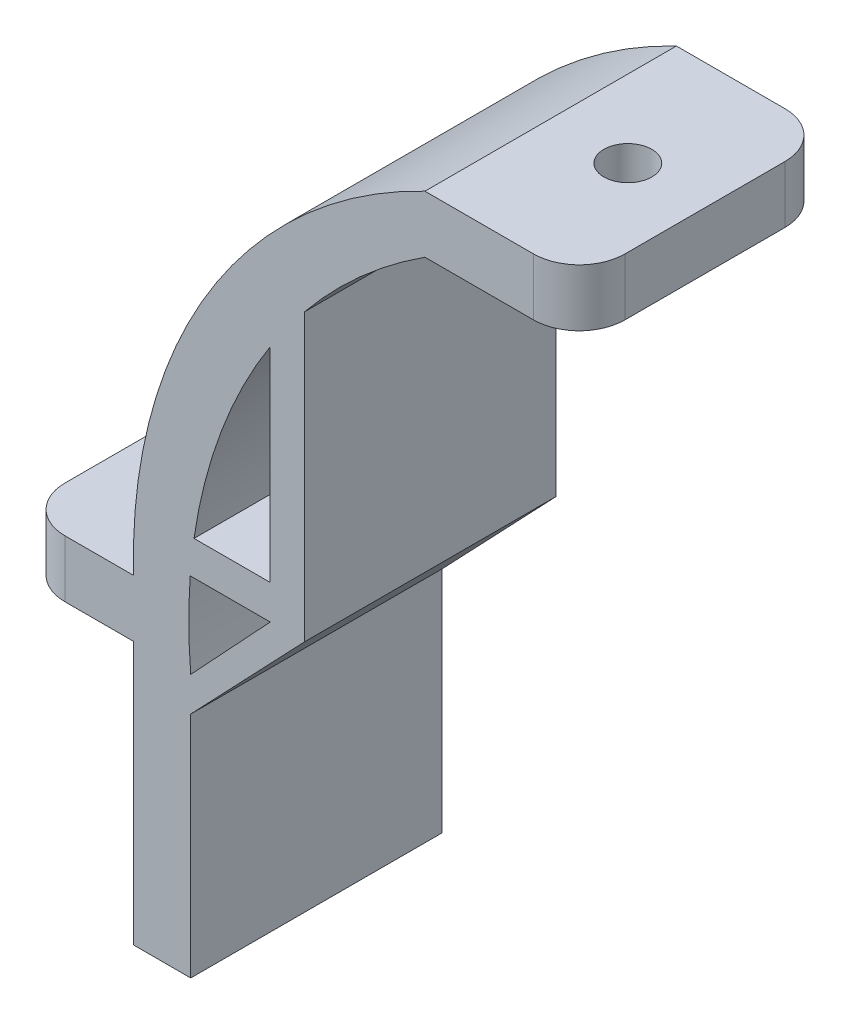
ISO-10303-21;
HEADER;
FILE_DESCRIPTION(('STEP AP214'),'2;1');
FILE_NAME('part.step','',(''),(''),'','','');
FILE_SCHEMA(('AUTOMOTIVE_DESIGN { 1 0 10303 214 1 1 1 1 }'));
ENDSEC;
DATA;
#1=APPLICATION_CONTEXT('core data for automotive mechanical design processes');
#2=APPLICATION_PROTOCOL_DEFINITION('international standard','automotive_design',2000,#1);
#3=PRODUCT_CONTEXT('',#1,'mechanical');
#4=PRODUCT('Part','Part','',(#3));
#5=PRODUCT_RELATED_PRODUCT_CATEGORY('part','',(#4));
#6=PRODUCT_DEFINITION_FORMATION('','',#4);
#7=PRODUCT_DEFINITION_CONTEXT('part definition',#1,'design');
#8=PRODUCT_DEFINITION('design','',#6,#7);
#9=PRODUCT_DEFINITION_SHAPE('','',#8);
#10=(LENGTH_UNIT() NAMED_UNIT(*) SI_UNIT(.MILLI.,.METRE.));
#11=(NAMED_UNIT(*) PLANE_ANGLE_UNIT() SI_UNIT($,.RADIAN.));
#12=(NAMED_UNIT(*) SI_UNIT($,.STERADIAN.) SOLID_ANGLE_UNIT());
#13=UNCERTAINTY_MEASURE_WITH_UNIT(LENGTH_MEASURE(1.E-05),#10,'distance_accuracy_value','');
#14=(GEOMETRIC_REPRESENTATION_CONTEXT(3) GLOBAL_UNCERTAINTY_ASSIGNED_CONTEXT((#13)) GLOBAL_UNIT_ASSIGNED_CONTEXT((#10,
#11,#12)) REPRESENTATION_CONTEXT('',''));
#15=CARTESIAN_POINT('',(0.,0.,0.));
#16=DIRECTION('',(0.,0.,1.));
#17=DIRECTION('',(1.,0.,0.));
#18=AXIS2_PLACEMENT_3D('',#15,#16,#17);
#19=CARTESIAN_POINT('',(0.,225.859750776681,0.));
#20=DIRECTION('',(0.,1.,0.));
#21=DIRECTION('',(0.,0.,1.));
#22=AXIS2_PLACEMENT_3D('',#19,#20,#21);
#23=PLANE('',#22);
#24=DIRECTION('',(0.,0.,1.));
#25=VECTOR('',#24,1.);
#26=CARTESIAN_POINT('',(-25.2653617340679,225.859750776681,0.));
#27=LINE('',#26,#25);
#28=CARTESIAN_POINT('',(-25.2653617340679,225.859750776681,-3.));
#29=VERTEX_POINT('',#28);
#30=CARTESIAN_POINT('',(-25.2653617340679,225.859750776681,19.));
#31=VERTEX_POINT('',#30);
#32=EDGE_CURVE('E377',#29,#31,#27,.T.);
#33=ORIENTED_EDGE('',*,*,#32,.T.);
#34=DIRECTION('',(-1.,0.,0.));
#35=VECTOR('',#34,1.);
#36=CARTESIAN_POINT('',(0.,225.859750776681,19.));
#37=LINE('',#36,#35);
#38=CARTESIAN_POINT('',(-18.5973694260722,225.859750776681,19.));
#39=VERTEX_POINT('',#38);
#40=EDGE_CURVE('E330',#39,#31,#37,.T.);
#41=ORIENTED_EDGE('',*,*,#40,.F.);
#42=DIRECTION('',(0.,0.,1.));
#43=VECTOR('',#42,1.);
#44=CARTESIAN_POINT('',(-18.5973694260722,225.859750776681,0.));
#45=LINE('',#44,#43);
#46=CARTESIAN_POINT('',(-18.5973694260722,225.859750776681,-3.));
#47=VERTEX_POINT('',#46);
#48=EDGE_CURVE('E380',#47,#39,#45,.T.);
#49=ORIENTED_EDGE('',*,*,#48,.F.);
#50=DIRECTION('',(1.,0.,0.));
#51=VECTOR('',#50,1.);
#52=CARTESIAN_POINT('',(0.,225.859750776681,-3.));
#53=LINE('',#52,#51);
#54=EDGE_CURVE('E267',#29,#47,#53,.T.);
#55=ORIENTED_EDGE('',*,*,#54,.F.);
#56=EDGE_LOOP('',(#33,#41,#49,#55));
#57=FACE_BOUND('',#56,.T.);
#58=ADVANCED_FACE('F41',(#57),#23,.T.);
#59=CARTESIAN_POINT('',(-18.5973694260721,0.,0.));
#60=DIRECTION('',(-1.,0.,0.));
#61=DIRECTION('',(0.,-1.,0.));
#62=AXIS2_PLACEMENT_3D('',#59,#60,#61);
#63=PLANE('',#62);
#64=ORIENTED_EDGE('',*,*,#48,.T.);
#65=DIRECTION('',(0.,-1.,0.));
#66=VECTOR('',#65,1.);
#67=CARTESIAN_POINT('',(-18.5973694260721,0.,19.));
#68=LINE('',#67,#66);
#69=CARTESIAN_POINT('',(-18.5973694260722,243.723778379767,19.));
#70=VERTEX_POINT('',#69);
#71=EDGE_CURVE('E326',#70,#39,#68,.T.);
#72=ORIENTED_EDGE('',*,*,#71,.F.);
#73=DIRECTION('',(0.,0.,1.));
#74=VECTOR('',#73,1.);
#75=CARTESIAN_POINT('',(-18.5973694260722,243.723778379767,0.));
#76=LINE('',#75,#74);
#77=CARTESIAN_POINT('',(-18.5973694260722,243.723778379767,-3.));
#78=VERTEX_POINT('',#77);
#79=EDGE_CURVE('E359',#78,#70,#76,.T.);
#80=ORIENTED_EDGE('',*,*,#79,.F.);
#81=DIRECTION('',(0.,1.,0.));
#82=VECTOR('',#81,1.);
#83=CARTESIAN_POINT('',(-18.5973694260721,0.,-3.));
#84=LINE('',#83,#82);
#85=EDGE_CURVE('E259',#47,#78,#84,.T.);
#86=ORIENTED_EDGE('',*,*,#85,.F.);
#87=EDGE_LOOP('',(#64,#72,#80,#86));
#88=FACE_BOUND('',#87,.T.);
#89=ADVANCED_FACE('F477',(#88),#63,.T.);
#90=CARTESIAN_POINT('',(19.2704077275692,219.412639915224,45.));
#91=DIRECTION('',(0.,0.,-1.));
#92=DIRECTION('',(-1.,0.,0.));
#93=AXIS2_PLACEMENT_3D('',#90,#91,#92);
#94=CYLINDRICAL_SURFACE('',#93,45.);
#95=ORIENTED_EDGE('',*,*,#79,.T.);
#96=CARTESIAN_POINT('',(19.2704077275692,219.412639915224,19.));
#97=DIRECTION('',(0.,0.,1.));
#98=DIRECTION('',(1.,0.,0.));
#99=AXIS2_PLACEMENT_3D('',#96,#97,#98);
#100=CIRCLE('',#99,45.);
#101=EDGE_CURVE('E322',#31,#70,#100,.F.);
#102=ORIENTED_EDGE('',*,*,#101,.F.);
#103=ORIENTED_EDGE('',*,*,#32,.F.);
#104=CARTESIAN_POINT('',(19.2704077275692,219.412639915224,-3.));
#105=DIRECTION('',(0.,0.,-1.));
#106=DIRECTION('',(-1.,0.,0.));
#107=AXIS2_PLACEMENT_3D('',#104,#105,#106);
#108=CIRCLE('',#107,45.);
#109=EDGE_CURVE('E263',#78,#29,#108,.F.);
#110=ORIENTED_EDGE('',*,*,#109,.F.);
#111=EDGE_LOOP('',(#95,#102,#103,#110));
#112=FACE_BOUND('',#111,.T.);
#113=ADVANCED_FACE('F483',(#112),#94,.F.);
#114=CARTESIAN_POINT('',(0.,222.859750776681,0.));
#115=DIRECTION('',(0.,-1.,0.));
#116=DIRECTION('',(0.,0.,-1.));
#117=AXIS2_PLACEMENT_3D('',#114,#115,#116);
#118=PLANE('',#117);
#119=DIRECTION('',(0.,0.,1.));
#120=VECTOR('',#119,1.);
#121=CARTESIAN_POINT('',(-18.5973694260722,222.859750776681,0.));
#122=LINE('',#121,#120);
#123=CARTESIAN_POINT('',(-18.5973694260722,222.859750776681,-3.));
#124=VERTEX_POINT('',#123);
#125=CARTESIAN_POINT('',(-18.5973694260722,222.859750776681,19.));
#126=VERTEX_POINT('',#125);
#127=EDGE_CURVE('E371',#124,#126,#122,.T.);
#128=ORIENTED_EDGE('',*,*,#127,.T.);
#129=DIRECTION('',(1.,0.,0.));
#130=VECTOR('',#129,1.);
#131=CARTESIAN_POINT('',(0.,222.859750776681,19.));
#132=LINE('',#131,#130);
#133=CARTESIAN_POINT('',(-25.5973694260722,222.859750776681,19.));
#134=VERTEX_POINT('',#133);
#135=EDGE_CURVE('E338',#134,#126,#132,.T.);
#136=ORIENTED_EDGE('',*,*,#135,.F.);
#137=DIRECTION('',(0.,0.,1.));
#138=VECTOR('',#137,1.);
#139=CARTESIAN_POINT('',(-25.5973694260722,222.859750776681,0.));
#140=LINE('',#139,#138);
#141=CARTESIAN_POINT('',(-25.5973694260722,222.859750776681,-3.));
#142=VERTEX_POINT('',#141);
#143=EDGE_CURVE('E374',#142,#134,#140,.T.);
#144=ORIENTED_EDGE('',*,*,#143,.F.);
#145=DIRECTION('',(-1.,0.,0.));
#146=VECTOR('',#145,1.);
#147=CARTESIAN_POINT('',(0.,222.859750776681,-3.));
#148=LINE('',#147,#146);
#149=EDGE_CURVE('E271',#124,#142,#148,.T.);
#150=ORIENTED_EDGE('',*,*,#149,.F.);
#151=EDGE_LOOP('',(#128,#136,#144,#150));
#152=FACE_BOUND('',#151,.T.);
#153=ADVANCED_FACE('F487',(#152),#118,.T.);
#154=CARTESIAN_POINT('',(-121.103180433286,113.114334706377,0.));
#155=DIRECTION('',(-0.730800263175056,0.682591367762052,0.));
#156=DIRECTION('',(-0.682591367762052,-0.730800263175056,0.));
#157=AXIS2_PLACEMENT_3D('',#154,#155,#156);
#158=PLANE('',#157);
#159=DIRECTION('',(0.,0.,-1.));
#160=VECTOR('',#159,1.);
#161=CARTESIAN_POINT('',(-25.5516147708674,215.414352888303,45.));
#162=LINE('',#161,#160);
#163=CARTESIAN_POINT('',(-25.5516147708673,215.414352888303,19.));
#164=VERTEX_POINT('',#163);
#165=CARTESIAN_POINT('',(-25.5516147708674,215.414352888303,-3.));
#166=VERTEX_POINT('',#165);
#167=EDGE_CURVE('E362',#164,#166,#162,.T.);
#168=ORIENTED_EDGE('',*,*,#167,.F.);
#169=DIRECTION('',(-0.682591367762052,-0.730800263175056,0.));
#170=VECTOR('',#169,1.);
#171=CARTESIAN_POINT('',(-121.103180433286,113.114334706377,19.));
#172=LINE('',#171,#170);
#173=EDGE_CURVE('E342',#126,#164,#172,.T.);
#174=ORIENTED_EDGE('',*,*,#173,.F.);
#175=ORIENTED_EDGE('',*,*,#127,.F.);
#176=DIRECTION('',(0.682591367762052,0.730800263175056,0.));
#177=VECTOR('',#176,1.);
#178=CARTESIAN_POINT('',(-121.103180433286,113.114334706377,-3.));
#179=LINE('',#178,#177);
#180=EDGE_CURVE('E279',#166,#124,#179,.T.);
#181=ORIENTED_EDGE('',*,*,#180,.F.);
#182=EDGE_LOOP('',(#168,#174,#175,#181));
#183=FACE_BOUND('',#182,.T.);
#184=ADVANCED_FACE('F579',(#183),#158,.T.);
#185=ORIENTED_EDGE('',*,*,#143,.T.);
#186=CARTESIAN_POINT('',(19.2704077275692,219.412639915224,19.));
#187=DIRECTION('',(0.,0.,1.));
#188=DIRECTION('',(1.,0.,0.));
#189=AXIS2_PLACEMENT_3D('',#186,#187,#188);
#190=CIRCLE('',#189,45.);
#191=EDGE_CURVE('E334',#164,#134,#190,.F.);
#192=ORIENTED_EDGE('',*,*,#191,.F.);
#193=ORIENTED_EDGE('',*,*,#167,.T.);
#194=CARTESIAN_POINT('',(19.2704077275692,219.412639915224,-3.));
#195=DIRECTION('',(0.,0.,-1.));
#196=DIRECTION('',(-1.,0.,0.));
#197=AXIS2_PLACEMENT_3D('',#194,#195,#196);
#198=CIRCLE('',#197,45.);
#199=EDGE_CURVE('E275',#142,#166,#198,.F.);
#200=ORIENTED_EDGE('',*,*,#199,.F.);
#201=EDGE_LOOP('',(#185,#192,#193,#200));
#202=FACE_BOUND('',#201,.T.);
#203=ADVANCED_FACE('F493',(#202),#94,.F.);
#204=CARTESIAN_POINT('',(-25.5516147708674,0.,45.));
#205=DIRECTION('',(1.,0.,0.));
#206=DIRECTION('',(0.,0.,-1.));
#207=AXIS2_PLACEMENT_3D('',#204,#205,#206);
#208=PLANE('',#207);
#209=DIRECTION('',(0.,0.,1.));
#210=VECTOR('',#209,1.);
#211=CARTESIAN_POINT('',(-25.5516147708674,212.414352888303,0.));
#212=LINE('',#211,#210);
#213=CARTESIAN_POINT('',(-25.5516147708674,212.414352888303,-3.));
#214=VERTEX_POINT('',#213);
#215=CARTESIAN_POINT('',(-25.5516147708673,212.414352888303,19.));
#216=VERTEX_POINT('',#215);
#217=EDGE_CURVE('E368',#214,#216,#212,.T.);
#218=ORIENTED_EDGE('',*,*,#217,.T.);
#219=DIRECTION('',(0.,1.,0.));
#220=VECTOR('',#219,1.);
#221=CARTESIAN_POINT('',(-25.5516147708674,0.,19.));
#222=LINE('',#221,#220);
#223=CARTESIAN_POINT('',(-25.5516147708674,192.414352888303,19.));
#224=VERTEX_POINT('',#223);
#225=EDGE_CURVE('E305',#224,#216,#222,.T.);
#226=ORIENTED_EDGE('',*,*,#225,.F.);
#227=DIRECTION('',(0.,0.,-1.));
#228=VECTOR('',#227,1.);
#229=CARTESIAN_POINT('',(-25.5516147708674,192.414352888303,45.));
#230=LINE('',#229,#228);
#231=CARTESIAN_POINT('',(-25.5516147708674,192.414352888303,-3.));
#232=VERTEX_POINT('',#231);
#233=EDGE_CURVE('E385',#224,#232,#230,.T.);
#234=ORIENTED_EDGE('',*,*,#233,.T.);
#235=DIRECTION('',(0.,-1.,0.));
#236=VECTOR('',#235,1.);
#237=CARTESIAN_POINT('',(-25.5516147708674,0.,-3.));
#238=LINE('',#237,#236);
#239=EDGE_CURVE('E234',#214,#232,#238,.T.);
#240=ORIENTED_EDGE('',*,*,#239,.F.);
#241=EDGE_LOOP('',(#218,#226,#234,#240));
#242=FACE_BOUND('',#241,.T.);
#243=ADVANCED_FACE('F490',(#242),#208,.T.);
#244=DIRECTION('',(0.,0.,-1.));
#245=VECTOR('',#244,1.);
#246=CARTESIAN_POINT('',(-5.06519953005821,257.264696918807,45.));
#247=LINE('',#246,#245);
#248=CARTESIAN_POINT('',(-5.0651995300582,257.264696918807,19.));
#249=VERTEX_POINT('',#248);
#250=CARTESIAN_POINT('',(-5.06519953005819,257.264696918807,-3.));
#251=VERTEX_POINT('',#250);
#252=EDGE_CURVE('E211',#249,#251,#247,.T.);
#253=ORIENTED_EDGE('',*,*,#252,.F.);
#254=CARTESIAN_POINT('',(19.2704077275692,219.412639915224,19.));
#255=DIRECTION('',(0.,0.,1.));
#256=DIRECTION('',(1.,0.,0.));
#257=AXIS2_PLACEMENT_3D('',#254,#255,#256);
#258=CIRCLE('',#257,45.);
#259=CARTESIAN_POINT('',(-15.5973694260722,247.859750776681,19.));
#260=VERTEX_POINT('',#259);
#261=EDGE_CURVE('E317',#260,#249,#258,.F.);
#262=ORIENTED_EDGE('',*,*,#261,.F.);
#263=DIRECTION('',(0.,0.,1.));
#264=VECTOR('',#263,1.);
#265=CARTESIAN_POINT('',(-15.5973694260722,247.859750776681,0.));
#266=LINE('',#265,#264);
#267=CARTESIAN_POINT('',(-15.5973694260722,247.859750776681,-3.));
#268=VERTEX_POINT('',#267);
#269=EDGE_CURVE('E223',#268,#260,#266,.T.);
#270=ORIENTED_EDGE('',*,*,#269,.F.);
#271=CARTESIAN_POINT('',(19.2704077275692,219.412639915224,-3.));
#272=DIRECTION('',(0.,0.,-1.));
#273=DIRECTION('',(-1.,0.,0.));
#274=AXIS2_PLACEMENT_3D('',#271,#272,#273);
#275=CIRCLE('',#274,45.);
#276=EDGE_CURVE('E203',#251,#268,#275,.F.);
#277=ORIENTED_EDGE('',*,*,#276,.F.);
#278=EDGE_LOOP('',(#253,#262,#270,#277));
#279=FACE_BOUND('',#278,.T.);
#280=ADVANCED_FACE('F222',(#279),#94,.F.);
#281=CARTESIAN_POINT('',(0.,257.264696918807,45.));
#282=DIRECTION('',(0.,-1.,0.));
#283=DIRECTION('',(0.,0.,-1.));
#284=AXIS2_PLACEMENT_3D('',#281,#282,#283);
#285=PLANE('',#284);
#286=DIRECTION('',(0.,0.,-1.));
#287=VECTOR('',#286,1.);
#288=CARTESIAN_POINT('',(8.43480046994179,257.264696918807,45.));
#289=LINE('',#288,#287);
#290=CARTESIAN_POINT('',(8.43480046994179,257.264696918807,15.));
#291=VERTEX_POINT('',#290);
#292=CARTESIAN_POINT('',(8.43480046994179,257.264696918807,1.00000000000001));
#293=VERTEX_POINT('',#292);
#294=EDGE_CURVE('E220',#291,#293,#289,.T.);
#295=ORIENTED_EDGE('',*,*,#294,.F.);
#296=CARTESIAN_POINT('',(4.43480046994179,257.264696918807,15.));
#297=DIRECTION('',(0.,-1.,0.));
#298=DIRECTION('',(0.,0.,-1.));
#299=AXIS2_PLACEMENT_3D('',#296,#297,#298);
#300=CIRCLE('',#299,4.);
#301=CARTESIAN_POINT('',(4.43480046994179,257.264696918807,19.));
#302=VERTEX_POINT('',#301);
#303=EDGE_CURVE('E11',#291,#302,#300,.T.);
#304=ORIENTED_EDGE('',*,*,#303,.T.);
#305=DIRECTION('',(1.,0.,0.));
#306=VECTOR('',#305,1.);
#307=CARTESIAN_POINT('',(0.,257.264696918807,19.));
#308=LINE('',#307,#306);
#309=EDGE_CURVE('E215',#249,#302,#308,.T.);
#310=ORIENTED_EDGE('',*,*,#309,.F.);
#311=ORIENTED_EDGE('',*,*,#252,.T.);
#312=DIRECTION('',(-1.,0.,0.));
#313=VECTOR('',#312,1.);
#314=CARTESIAN_POINT('',(0.,257.264696918807,-3.));
#315=LINE('',#314,#313);
#316=CARTESIAN_POINT('',(4.43480046994179,257.264696918807,-3.));
#317=VERTEX_POINT('',#316);
#318=EDGE_CURVE('E196',#317,#251,#315,.T.);
#319=ORIENTED_EDGE('',*,*,#318,.F.);
#320=CARTESIAN_POINT('',(4.43480046994179,257.264696918807,1.));
#321=DIRECTION('',(0.,-1.,0.));
#322=DIRECTION('',(0.,0.,-1.));
#323=AXIS2_PLACEMENT_3D('',#320,#321,#322);
#324=CIRCLE('',#323,4.);
#325=EDGE_CURVE('E50',#317,#293,#324,.T.);
#326=ORIENTED_EDGE('',*,*,#325,.T.);
#327=EDGE_LOOP('',(#295,#304,#310,#311,#319,#326));
#328=FACE_BOUND('',#327,.T.);
#329=CARTESIAN_POINT('',(1.68480046994179,257.264696918807,8.));
#330=DIRECTION('',(0.,-1.,0.));
#331=DIRECTION('',(0.,0.,-1.));
#332=AXIS2_PLACEMENT_3D('',#329,#330,#331);
#333=CIRCLE('',#332,2.1);
#334=CARTESIAN_POINT('',(1.68480046994179,257.264696918807,5.9));
#335=VERTEX_POINT('',#334);
#336=EDGE_CURVE('E350',#335,#335,#333,.T.);
#337=ORIENTED_EDGE('',*,*,#336,.F.);
#338=EDGE_LOOP('',(#337));
#339=FACE_BOUND('',#338,.T.);
#340=ADVANCED_FACE('F212',(#328,#339),#285,.T.);
#341=CARTESIAN_POINT('',(8.43480046994179,0.,45.));
#342=DIRECTION('',(1.,0.,0.));
#343=DIRECTION('',(0.,0.,-1.));
#344=AXIS2_PLACEMENT_3D('',#341,#342,#343);
#345=PLANE('',#344);
#346=DIRECTION('',(0.,0.,-1.));
#347=VECTOR('',#346,1.);
#348=CARTESIAN_POINT('',(8.43480046994179,262.264696918807,45.));
#349=LINE('',#348,#347);
#350=CARTESIAN_POINT('',(8.43480046994179,262.264696918807,15.));
#351=VERTEX_POINT('',#350);
#352=CARTESIAN_POINT('',(8.43480046994179,262.264696918807,1.00000000000001));
#353=VERTEX_POINT('',#352);
#354=EDGE_CURVE('E409',#351,#353,#349,.T.);
#355=ORIENTED_EDGE('',*,*,#354,.F.);
#356=DIRECTION('',(0.,1.,0.));
#357=VECTOR('',#356,1.);
#358=CARTESIAN_POINT('',(8.43480046994179,0.,15.));
#359=LINE('',#358,#357);
#360=EDGE_CURVE('E63',#351,#291,#359,.F.);
#361=ORIENTED_EDGE('',*,*,#360,.T.);
#362=ORIENTED_EDGE('',*,*,#294,.T.);
#363=DIRECTION('',(0.,-1.,0.));
#364=VECTOR('',#363,1.);
#365=CARTESIAN_POINT('',(8.43480046994179,0.,1.));
#366=LINE('',#365,#364);
#367=EDGE_CURVE('E456',#293,#353,#366,.F.);
#368=ORIENTED_EDGE('',*,*,#367,.T.);
#369=EDGE_LOOP('',(#355,#361,#362,#368));
#370=FACE_BOUND('',#369,.T.);
#371=ADVANCED_FACE('F462',(#370),#345,.T.);
#372=CARTESIAN_POINT('',(0.,262.264696918807,45.));
#373=DIRECTION('',(0.,-1.,0.));
#374=DIRECTION('',(0.,0.,-1.));
#375=AXIS2_PLACEMENT_3D('',#372,#373,#374);
#376=PLANE('',#375);
#377=CARTESIAN_POINT('',(1.68480046994179,262.264696918807,8.));
#378=DIRECTION('',(0.,1.,0.));
#379=DIRECTION('',(0.,0.,1.));
#380=AXIS2_PLACEMENT_3D('',#377,#378,#379);
#381=CIRCLE('',#380,2.1);
#382=CARTESIAN_POINT('',(1.68480046994179,262.264696918807,10.1));
#383=VERTEX_POINT('',#382);
#384=EDGE_CURVE('E346',#383,#383,#381,.T.);
#385=ORIENTED_EDGE('',*,*,#384,.F.);
#386=EDGE_LOOP('',(#385));
#387=FACE_BOUND('',#386,.T.);
#388=DIRECTION('',(-1.,0.,0.));
#389=VECTOR('',#388,1.);
#390=CARTESIAN_POINT('',(0.,262.264696918807,19.));
#391=LINE('',#390,#389);
#392=CARTESIAN_POINT('',(4.43480046994179,262.264696918807,19.));
#393=VERTEX_POINT('',#392);
#394=CARTESIAN_POINT('',(-5.06519953005817,262.264696918807,19.));
#395=VERTEX_POINT('',#394);
#396=EDGE_CURVE('E283',#393,#395,#391,.T.);
#397=ORIENTED_EDGE('',*,*,#396,.F.);
#398=CARTESIAN_POINT('',(4.43480046994179,262.264696918807,15.));
#399=DIRECTION('',(0.,-1.,0.));
#400=DIRECTION('',(0.,0.,-1.));
#401=AXIS2_PLACEMENT_3D('',#398,#399,#400);
#402=CIRCLE('',#401,4.);
#403=EDGE_CURVE('E453',#393,#351,#402,.F.);
#404=ORIENTED_EDGE('',*,*,#403,.T.);
#405=ORIENTED_EDGE('',*,*,#354,.T.);
#406=CARTESIAN_POINT('',(4.43480046994179,262.264696918807,1.));
#407=DIRECTION('',(0.,-1.,0.));
#408=DIRECTION('',(0.,0.,-1.));
#409=AXIS2_PLACEMENT_3D('',#406,#407,#408);
#410=CIRCLE('',#409,4.);
#411=CARTESIAN_POINT('',(4.43480046994179,262.264696918807,-3.));
#412=VERTEX_POINT('',#411);
#413=EDGE_CURVE('E450',#353,#412,#410,.F.);
#414=ORIENTED_EDGE('',*,*,#413,.T.);
#415=DIRECTION('',(1.,0.,0.));
#416=VECTOR('',#415,1.);
#417=CARTESIAN_POINT('',(0.,262.264696918807,-3.));
#418=LINE('',#417,#416);
#419=CARTESIAN_POINT('',(-5.0651995300582,262.264696918807,-3.));
#420=VERTEX_POINT('',#419);
#421=EDGE_CURVE('E256',#420,#412,#418,.T.);
#422=ORIENTED_EDGE('',*,*,#421,.F.);
#423=DIRECTION('',(0.,0.,-1.));
#424=VECTOR('',#423,1.);
#425=CARTESIAN_POINT('',(-5.06519953005821,262.264696918807,45.));
#426=LINE('',#425,#424);
#427=EDGE_CURVE('E406',#395,#420,#426,.T.);
#428=ORIENTED_EDGE('',*,*,#427,.F.);
#429=EDGE_LOOP('',(#397,#404,#405,#414,#422,#428));
#430=FACE_BOUND('',#429,.T.);
#431=ADVANCED_FACE('F467',(#387,#430),#376,.F.);
#432=CARTESIAN_POINT('',(14.4298215899234,221.70678583439,45.));
#433=DIRECTION('',(0.,0.,-1.));
#434=DIRECTION('',(-1.,0.,0.));
#435=AXIS2_PLACEMENT_3D('',#432,#433,#434);
#436=CYLINDRICAL_SURFACE('',#435,45.);
#437=DIRECTION('',(0.,0.,-1.));
#438=VECTOR('',#437,1.);
#439=CARTESIAN_POINT('',(-30.5516147708674,220.414352888303,45.));
#440=LINE('',#439,#438);
#441=CARTESIAN_POINT('',(-30.5516147708674,220.414352888303,19.));
#442=VERTEX_POINT('',#441);
#443=CARTESIAN_POINT('',(-30.5516147708674,220.414352888303,-3.));
#444=VERTEX_POINT('',#443);
#445=EDGE_CURVE('E402',#442,#444,#440,.T.);
#446=ORIENTED_EDGE('',*,*,#445,.F.);
#447=CARTESIAN_POINT('',(14.4298215899234,221.70678583439,19.));
#448=DIRECTION('',(0.,0.,1.));
#449=DIRECTION('',(1.,0.,0.));
#450=AXIS2_PLACEMENT_3D('',#447,#448,#449);
#451=CIRCLE('',#450,45.);
#452=EDGE_CURVE('E286',#395,#442,#451,.T.);
#453=ORIENTED_EDGE('',*,*,#452,.F.);
#454=ORIENTED_EDGE('',*,*,#427,.T.);
#455=CARTESIAN_POINT('',(14.4298215899234,221.70678583439,-3.));
#456=DIRECTION('',(0.,0.,-1.));
#457=DIRECTION('',(-1.,0.,0.));
#458=AXIS2_PLACEMENT_3D('',#455,#456,#457);
#459=CIRCLE('',#458,45.);
#460=EDGE_CURVE('E252',#444,#420,#459,.T.);
#461=ORIENTED_EDGE('',*,*,#460,.F.);
#462=EDGE_LOOP('',(#446,#453,#454,#461));
#463=FACE_BOUND('',#462,.T.);
#464=ADVANCED_FACE('F515',(#463),#436,.T.);
#465=CARTESIAN_POINT('',(0.,220.414352888303,45.));
#466=DIRECTION('',(0.,1.,0.));
#467=DIRECTION('',(0.,0.,1.));
#468=AXIS2_PLACEMENT_3D('',#465,#466,#467);
#469=PLANE('',#468);
#470=DIRECTION('',(1.,0.,0.));
#471=VECTOR('',#470,1.);
#472=CARTESIAN_POINT('',(0.,220.414352888303,-3.));
#473=LINE('',#472,#471);
#474=CARTESIAN_POINT('',(-36.5516147708674,220.414352888303,-3.));
#475=VERTEX_POINT('',#474);
#476=EDGE_CURVE('E249',#475,#444,#473,.T.);
#477=ORIENTED_EDGE('',*,*,#476,.F.);
#478=CARTESIAN_POINT('',(-36.5516147708674,220.414352888303,1.));
#479=DIRECTION('',(0.,1.,0.));
#480=DIRECTION('',(0.,0.,1.));
#481=AXIS2_PLACEMENT_3D('',#478,#479,#480);
#482=CIRCLE('',#481,4.);
#483=CARTESIAN_POINT('',(-40.5516147708674,220.414352888303,1.00000000000001));
#484=VERTEX_POINT('',#483);
#485=EDGE_CURVE('E427',#475,#484,#482,.T.);
#486=ORIENTED_EDGE('',*,*,#485,.T.);
#487=DIRECTION('',(0.,0.,-1.));
#488=VECTOR('',#487,1.);
#489=CARTESIAN_POINT('',(-40.5516147708674,220.414352888303,45.));
#490=LINE('',#489,#488);
#491=CARTESIAN_POINT('',(-40.5516147708674,220.414352888303,15.));
#492=VERTEX_POINT('',#491);
#493=EDGE_CURVE('E398',#492,#484,#490,.T.);
#494=ORIENTED_EDGE('',*,*,#493,.F.);
#495=CARTESIAN_POINT('',(-36.5516147708674,220.414352888303,15.));
#496=DIRECTION('',(0.,1.,0.));
#497=DIRECTION('',(0.,0.,1.));
#498=AXIS2_PLACEMENT_3D('',#495,#496,#497);
#499=CIRCLE('',#498,4.);
#500=CARTESIAN_POINT('',(-36.5516147708674,220.414352888303,19.));
#501=VERTEX_POINT('',#500);
#502=EDGE_CURVE('E424',#492,#501,#499,.T.);
#503=ORIENTED_EDGE('',*,*,#502,.T.);
#504=DIRECTION('',(-1.,0.,0.));
#505=VECTOR('',#504,1.);
#506=CARTESIAN_POINT('',(0.,220.414352888303,19.));
#507=LINE('',#506,#505);
#508=EDGE_CURVE('E290',#442,#501,#507,.T.);
#509=ORIENTED_EDGE('',*,*,#508,.F.);
#510=ORIENTED_EDGE('',*,*,#445,.T.);
#511=EDGE_LOOP('',(#477,#486,#494,#503,#509,#510));
#512=FACE_BOUND('',#511,.T.);
#513=CARTESIAN_POINT('',(-35.5516147708674,220.414352888303,8.));
#514=DIRECTION('',(0.,1.,0.));
#515=DIRECTION('',(0.,0.,1.));
#516=AXIS2_PLACEMENT_3D('',#513,#514,#515);
#517=CIRCLE('',#516,2.1);
#518=CARTESIAN_POINT('',(-35.5516147708674,220.414352888303,10.1));
#519=VERTEX_POINT('',#518);
#520=EDGE_CURVE('E354',#519,#519,#517,.T.);
#521=ORIENTED_EDGE('',*,*,#520,.F.);
#522=EDGE_LOOP('',(#521));
#523=FACE_BOUND('',#522,.T.);
#524=ADVANCED_FACE('F511',(#512,#523),#469,.T.);
#525=CARTESIAN_POINT('',(-40.5516147708674,0.,45.));
#526=DIRECTION('',(-1.,0.,0.));
#527=DIRECTION('',(0.,0.,1.));
#528=AXIS2_PLACEMENT_3D('',#525,#526,#527);
#529=PLANE('',#528);
#530=ORIENTED_EDGE('',*,*,#493,.T.);
#531=DIRECTION('',(0.,1.,0.));
#532=VECTOR('',#531,1.);
#533=CARTESIAN_POINT('',(-40.5516147708674,0.,1.));
#534=LINE('',#533,#532);
#535=CARTESIAN_POINT('',(-40.5516147708674,215.414352888303,1.00000000000001));
#536=VERTEX_POINT('',#535);
#537=EDGE_CURVE('E433',#484,#536,#534,.F.);
#538=ORIENTED_EDGE('',*,*,#537,.T.);
#539=DIRECTION('',(0.,0.,-1.));
#540=VECTOR('',#539,1.);
#541=CARTESIAN_POINT('',(-40.5516147708674,215.414352888303,45.));
#542=LINE('',#541,#540);
#543=CARTESIAN_POINT('',(-40.5516147708674,215.414352888303,15.));
#544=VERTEX_POINT('',#543);
#545=EDGE_CURVE('E394',#544,#536,#542,.T.);
#546=ORIENTED_EDGE('',*,*,#545,.F.);
#547=DIRECTION('',(0.,-1.,0.));
#548=VECTOR('',#547,1.);
#549=CARTESIAN_POINT('',(-40.5516147708674,0.,15.));
#550=LINE('',#549,#548);
#551=EDGE_CURVE('E430',#544,#492,#550,.F.);
#552=ORIENTED_EDGE('',*,*,#551,.T.);
#553=EDGE_LOOP('',(#530,#538,#546,#552));
#554=FACE_BOUND('',#553,.T.);
#555=ADVANCED_FACE('F507',(#554),#529,.T.);
#556=CARTESIAN_POINT('',(0.,215.414352888303,45.));
#557=DIRECTION('',(0.,1.,0.));
#558=DIRECTION('',(0.,0.,1.));
#559=AXIS2_PLACEMENT_3D('',#556,#557,#558);
#560=PLANE('',#559);
#561=CARTESIAN_POINT('',(-35.5516147708674,215.414352888303,8.));
#562=DIRECTION('',(0.,1.,0.));
#563=DIRECTION('',(0.,0.,1.));
#564=AXIS2_PLACEMENT_3D('',#561,#562,#563);
#565=CIRCLE('',#564,2.1);
#566=CARTESIAN_POINT('',(-35.5516147708674,215.414352888303,10.1));
#567=VERTEX_POINT('',#566);
#568=EDGE_CURVE('E358',#567,#567,#565,.T.);
#569=ORIENTED_EDGE('',*,*,#568,.T.);
#570=EDGE_LOOP('',(#569));
#571=FACE_BOUND('',#570,.T.);
#572=ORIENTED_EDGE('',*,*,#545,.T.);
#573=CARTESIAN_POINT('',(-36.5516147708674,215.414352888303,1.));
#574=DIRECTION('',(0.,1.,0.));
#575=DIRECTION('',(0.,0.,1.));
#576=AXIS2_PLACEMENT_3D('',#573,#574,#575);
#577=CIRCLE('',#576,4.);
#578=CARTESIAN_POINT('',(-36.5516147708674,215.414352888303,-3.));
#579=VERTEX_POINT('',#578);
#580=EDGE_CURVE('E439',#536,#579,#577,.F.);
#581=ORIENTED_EDGE('',*,*,#580,.T.);
#582=DIRECTION('',(-1.,0.,0.));
#583=VECTOR('',#582,1.);
#584=CARTESIAN_POINT('',(0.,215.414352888303,-3.));
#585=LINE('',#584,#583);
#586=CARTESIAN_POINT('',(-30.5516147708674,215.414352888303,-3.));
#587=VERTEX_POINT('',#586);
#588=EDGE_CURVE('E246',#587,#579,#585,.T.);
#589=ORIENTED_EDGE('',*,*,#588,.F.);
#590=DIRECTION('',(0.,0.,-1.));
#591=VECTOR('',#590,1.);
#592=CARTESIAN_POINT('',(-30.5516147708674,215.414352888303,45.));
#593=LINE('',#592,#591);
#594=CARTESIAN_POINT('',(-30.5516147708674,215.414352888303,19.));
#595=VERTEX_POINT('',#594);
#596=EDGE_CURVE('E391',#595,#587,#593,.T.);
#597=ORIENTED_EDGE('',*,*,#596,.F.);
#598=DIRECTION('',(1.,0.,0.));
#599=VECTOR('',#598,1.);
#600=CARTESIAN_POINT('',(0.,215.414352888303,19.));
#601=LINE('',#600,#599);
#602=CARTESIAN_POINT('',(-36.5516147708674,215.414352888303,19.));
#603=VERTEX_POINT('',#602);
#604=EDGE_CURVE('E294',#603,#595,#601,.T.);
#605=ORIENTED_EDGE('',*,*,#604,.F.);
#606=CARTESIAN_POINT('',(-36.5516147708674,215.414352888303,15.));
#607=DIRECTION('',(0.,1.,0.));
#608=DIRECTION('',(0.,0.,1.));
#609=AXIS2_PLACEMENT_3D('',#606,#607,#608);
#610=CIRCLE('',#609,4.);
#611=EDGE_CURVE('E436',#603,#544,#610,.F.);
#612=ORIENTED_EDGE('',*,*,#611,.T.);
#613=EDGE_LOOP('',(#572,#581,#589,#597,#605,#612));
#614=FACE_BOUND('',#613,.T.);
#615=ADVANCED_FACE('F503',(#571,#614),#560,.F.);
#616=CARTESIAN_POINT('',(-30.5516147708674,0.,45.));
#617=DIRECTION('',(1.,0.,0.));
#618=DIRECTION('',(0.,0.,-1.));
#619=AXIS2_PLACEMENT_3D('',#616,#617,#618);
#620=PLANE('',#619);
#621=DIRECTION('',(0.,0.,-1.));
#622=VECTOR('',#621,1.);
#623=CARTESIAN_POINT('',(-30.5516147708674,192.414352888303,45.));
#624=LINE('',#623,#622);
#625=CARTESIAN_POINT('',(-30.5516147708674,192.414352888303,19.));
#626=VERTEX_POINT('',#625);
#627=CARTESIAN_POINT('',(-30.5516147708674,192.414352888303,-3.));
#628=VERTEX_POINT('',#627);
#629=EDGE_CURVE('E388',#626,#628,#624,.T.);
#630=ORIENTED_EDGE('',*,*,#629,.F.);
#631=DIRECTION('',(0.,-1.,0.));
#632=VECTOR('',#631,1.);
#633=CARTESIAN_POINT('',(-30.5516147708674,0.,19.));
#634=LINE('',#633,#632);
#635=EDGE_CURVE('E297',#595,#626,#634,.T.);
#636=ORIENTED_EDGE('',*,*,#635,.F.);
#637=ORIENTED_EDGE('',*,*,#596,.T.);
#638=DIRECTION('',(0.,-1.,0.));
#639=VECTOR('',#638,1.);
#640=CARTESIAN_POINT('',(-30.5516147708674,0.,-3.));
#641=LINE('',#640,#639);
#642=EDGE_CURVE('E242',#587,#628,#641,.T.);
#643=ORIENTED_EDGE('',*,*,#642,.T.);
#644=EDGE_LOOP('',(#630,#636,#637,#643));
#645=FACE_BOUND('',#644,.T.);
#646=ADVANCED_FACE('F499',(#645),#620,.F.);
#647=CARTESIAN_POINT('',(0.,192.414352888303,45.));
#648=DIRECTION('',(0.,1.,0.));
#649=DIRECTION('',(0.,0.,1.));
#650=AXIS2_PLACEMENT_3D('',#647,#648,#649);
#651=PLANE('',#650);
#652=ORIENTED_EDGE('',*,*,#233,.F.);
#653=DIRECTION('',(1.,0.,0.));
#654=VECTOR('',#653,1.);
#655=CARTESIAN_POINT('',(0.,192.414352888303,19.));
#656=LINE('',#655,#654);
#657=EDGE_CURVE('E301',#626,#224,#656,.T.);
#658=ORIENTED_EDGE('',*,*,#657,.F.);
#659=ORIENTED_EDGE('',*,*,#629,.T.);
#660=DIRECTION('',(-1.,0.,0.));
#661=VECTOR('',#660,1.);
#662=CARTESIAN_POINT('',(0.,192.414352888303,-3.));
#663=LINE('',#662,#661);
#664=EDGE_CURVE('E238',#232,#628,#663,.T.);
#665=ORIENTED_EDGE('',*,*,#664,.F.);
#666=EDGE_LOOP('',(#652,#658,#659,#665));
#667=FACE_BOUND('',#666,.T.);
#668=ADVANCED_FACE('F495',(#667),#651,.F.);
#669=CARTESIAN_POINT('',(-15.5973694260722,0.,0.));
#670=DIRECTION('',(1.,0.,0.));
#671=DIRECTION('',(0.,0.,-1.));
#672=AXIS2_PLACEMENT_3D('',#669,#670,#671);
#673=PLANE('',#672);
#674=ORIENTED_EDGE('',*,*,#269,.T.);
#675=DIRECTION('',(0.,1.,0.));
#676=VECTOR('',#675,1.);
#677=CARTESIAN_POINT('',(-15.5973694260722,0.,19.));
#678=LINE('',#677,#676);
#679=CARTESIAN_POINT('',(-15.5973694260722,222.859750776681,19.));
#680=VERTEX_POINT('',#679);
#681=EDGE_CURVE('E313',#680,#260,#678,.T.);
#682=ORIENTED_EDGE('',*,*,#681,.F.);
#683=DIRECTION('',(0.,0.,1.));
#684=VECTOR('',#683,1.);
#685=CARTESIAN_POINT('',(-15.5973694260722,222.859750776681,0.));
#686=LINE('',#685,#684);
#687=CARTESIAN_POINT('',(-15.5973694260722,222.859750776681,-3.));
#688=VERTEX_POINT('',#687);
#689=EDGE_CURVE('E365',#688,#680,#686,.T.);
#690=ORIENTED_EDGE('',*,*,#689,.F.);
#691=DIRECTION('',(0.,-1.,0.));
#692=VECTOR('',#691,1.);
#693=CARTESIAN_POINT('',(-15.5973694260722,0.,-3.));
#694=LINE('',#693,#692);
#695=EDGE_CURVE('E225',#268,#688,#694,.T.);
#696=ORIENTED_EDGE('',*,*,#695,.F.);
#697=EDGE_LOOP('',(#674,#682,#690,#696));
#698=FACE_BOUND('',#697,.T.);
#699=ADVANCED_FACE('F498',(#698),#673,.T.);
#700=CARTESIAN_POINT('',(-119.474760714532,113.856943830399,0.));
#701=DIRECTION('',(-0.723921665353371,0.68988218010904,0.));
#702=DIRECTION('',(-0.68988218010904,-0.723921665353371,0.));
#703=AXIS2_PLACEMENT_3D('',#700,#701,#702);
#704=PLANE('',#703);
#705=ORIENTED_EDGE('',*,*,#689,.T.);
#706=DIRECTION('',(0.68988218010904,0.723921665353371,0.));
#707=VECTOR('',#706,1.);
#708=CARTESIAN_POINT('',(-119.474760714532,113.856943830399,19.));
#709=LINE('',#708,#707);
#710=EDGE_CURVE('E309',#216,#680,#709,.T.);
#711=ORIENTED_EDGE('',*,*,#710,.F.);
#712=ORIENTED_EDGE('',*,*,#217,.F.);
#713=DIRECTION('',(-0.68988218010904,-0.723921665353371,0.));
#714=VECTOR('',#713,1.);
#715=CARTESIAN_POINT('',(-119.474760714532,113.856943830399,-3.));
#716=LINE('',#715,#714);
#717=EDGE_CURVE('E228',#688,#214,#716,.T.);
#718=ORIENTED_EDGE('',*,*,#717,.F.);
#719=EDGE_LOOP('',(#705,#711,#712,#718));
#720=FACE_BOUND('',#719,.T.);
#721=ADVANCED_FACE('F566',(#720),#704,.F.);
#722=CARTESIAN_POINT('',(-35.5516147708674,211.414352888303,8.));
#723=DIRECTION('',(0.,1.,0.));
#724=DIRECTION('',(0.,0.,1.));
#725=AXIS2_PLACEMENT_3D('',#722,#723,#724);
#726=CYLINDRICAL_SURFACE('',#725,2.1);
#727=ORIENTED_EDGE('',*,*,#520,.T.);
#728=EDGE_LOOP('',(#727));
#729=FACE_BOUND('',#728,.T.);
#730=ORIENTED_EDGE('',*,*,#568,.F.);
#731=EDGE_LOOP('',(#730));
#732=FACE_BOUND('',#731,.T.);
#733=ADVANCED_FACE('F575',(#729,#732),#726,.F.);
#734=CARTESIAN_POINT('',(1.68480046994179,253.264696918807,8.));
#735=DIRECTION('',(0.,1.,0.));
#736=DIRECTION('',(0.,0.,1.));
#737=AXIS2_PLACEMENT_3D('',#734,#735,#736);
#738=CYLINDRICAL_SURFACE('',#737,2.1);
#739=ORIENTED_EDGE('',*,*,#336,.T.);
#740=EDGE_LOOP('',(#739));
#741=FACE_BOUND('',#740,.T.);
#742=ORIENTED_EDGE('',*,*,#384,.T.);
#743=EDGE_LOOP('',(#742));
#744=FACE_BOUND('',#743,.T.);
#745=ADVANCED_FACE('F601',(#741,#744),#738,.F.);
#746=CARTESIAN_POINT('',(0.,0.,19.));
#747=DIRECTION('',(0.,0.,1.));
#748=DIRECTION('',(1.,0.,0.));
#749=AXIS2_PLACEMENT_3D('',#746,#747,#748);
#750=PLANE('',#749);
#751=ORIENTED_EDGE('',*,*,#508,.T.);
#752=DIRECTION('',(0.,-1.,0.));
#753=VECTOR('',#752,1.);
#754=CARTESIAN_POINT('',(-36.5516147708674,0.,19.));
#755=LINE('',#754,#753);
#756=EDGE_CURVE('E446',#501,#603,#755,.T.);
#757=ORIENTED_EDGE('',*,*,#756,.T.);
#758=ORIENTED_EDGE('',*,*,#604,.T.);
#759=ORIENTED_EDGE('',*,*,#635,.T.);
#760=ORIENTED_EDGE('',*,*,#657,.T.);
#761=ORIENTED_EDGE('',*,*,#225,.T.);
#762=ORIENTED_EDGE('',*,*,#710,.T.);
#763=ORIENTED_EDGE('',*,*,#681,.T.);
#764=ORIENTED_EDGE('',*,*,#261,.T.);
#765=ORIENTED_EDGE('',*,*,#309,.T.);
#766=DIRECTION('',(0.,1.,0.));
#767=VECTOR('',#766,1.);
#768=CARTESIAN_POINT('',(4.43480046994179,0.,19.));
#769=LINE('',#768,#767);
#770=EDGE_CURVE('E442',#302,#393,#769,.T.);
#771=ORIENTED_EDGE('',*,*,#770,.T.);
#772=ORIENTED_EDGE('',*,*,#396,.T.);
#773=ORIENTED_EDGE('',*,*,#452,.T.);
#774=EDGE_LOOP('',(#751,#757,#758,#759,#760,#761,#762,#763,#764,#765,#771,#772,#773));
#775=FACE_BOUND('',#774,.T.);
#776=ORIENTED_EDGE('',*,*,#101,.T.);
#777=ORIENTED_EDGE('',*,*,#71,.T.);
#778=ORIENTED_EDGE('',*,*,#40,.T.);
#779=EDGE_LOOP('',(#776,#777,#778));
#780=FACE_BOUND('',#779,.T.);
#781=ORIENTED_EDGE('',*,*,#191,.T.);
#782=ORIENTED_EDGE('',*,*,#135,.T.);
#783=ORIENTED_EDGE('',*,*,#173,.T.);
#784=EDGE_LOOP('',(#781,#782,#783));
#785=FACE_BOUND('',#784,.T.);
#786=ADVANCED_FACE('F545',(#775,#780,#785),#750,.T.);
#787=CARTESIAN_POINT('',(0.,0.,-3.));
#788=DIRECTION('',(0.,0.,-1.));
#789=DIRECTION('',(-1.,0.,0.));
#790=AXIS2_PLACEMENT_3D('',#787,#788,#789);
#791=PLANE('',#790);
#792=ORIENTED_EDGE('',*,*,#588,.T.);
#793=DIRECTION('',(0.,1.,0.));
#794=VECTOR('',#793,1.);
#795=CARTESIAN_POINT('',(-36.5516147708674,0.,-3.));
#796=LINE('',#795,#794);
#797=EDGE_CURVE('E420',#579,#475,#796,.T.);
#798=ORIENTED_EDGE('',*,*,#797,.T.);
#799=ORIENTED_EDGE('',*,*,#476,.T.);
#800=ORIENTED_EDGE('',*,*,#460,.T.);
#801=ORIENTED_EDGE('',*,*,#421,.T.);
#802=DIRECTION('',(0.,-1.,0.));
#803=VECTOR('',#802,1.);
#804=CARTESIAN_POINT('',(4.43480046994179,0.,-3.));
#805=LINE('',#804,#803);
#806=EDGE_CURVE('E207',#412,#317,#805,.T.);
#807=ORIENTED_EDGE('',*,*,#806,.T.);
#808=ORIENTED_EDGE('',*,*,#318,.T.);
#809=ORIENTED_EDGE('',*,*,#276,.T.);
#810=ORIENTED_EDGE('',*,*,#695,.T.);
#811=ORIENTED_EDGE('',*,*,#717,.T.);
#812=ORIENTED_EDGE('',*,*,#239,.T.);
#813=ORIENTED_EDGE('',*,*,#664,.T.);
#814=ORIENTED_EDGE('',*,*,#642,.F.);
#815=EDGE_LOOP('',(#792,#798,#799,#800,#801,#807,#808,#809,#810,#811,#812,#813,#814));
#816=FACE_BOUND('',#815,.T.);
#817=ORIENTED_EDGE('',*,*,#85,.T.);
#818=ORIENTED_EDGE('',*,*,#109,.T.);
#819=ORIENTED_EDGE('',*,*,#54,.T.);
#820=EDGE_LOOP('',(#817,#818,#819));
#821=FACE_BOUND('',#820,.T.);
#822=ORIENTED_EDGE('',*,*,#149,.T.);
#823=ORIENTED_EDGE('',*,*,#199,.T.);
#824=ORIENTED_EDGE('',*,*,#180,.T.);
#825=EDGE_LOOP('',(#822,#823,#824));
#826=FACE_BOUND('',#825,.T.);
#827=ADVANCED_FACE('F199',(#816,#821,#826),#791,.T.);
#828=CARTESIAN_POINT('',(-36.5516147708674,0.,1.));
#829=DIRECTION('',(0.,1.,0.));
#830=DIRECTION('',(0.,0.,1.));
#831=AXIS2_PLACEMENT_3D('',#828,#829,#830);
#832=CYLINDRICAL_SURFACE('',#831,4.);
#833=ORIENTED_EDGE('',*,*,#580,.F.);
#834=ORIENTED_EDGE('',*,*,#537,.F.);
#835=ORIENTED_EDGE('',*,*,#485,.F.);
#836=ORIENTED_EDGE('',*,*,#797,.F.);
#837=EDGE_LOOP('',(#833,#834,#835,#836));
#838=FACE_BOUND('',#837,.T.);
#839=ADVANCED_FACE('F529',(#838),#832,.T.);
#840=CARTESIAN_POINT('',(-36.5516147708674,0.,15.));
#841=DIRECTION('',(0.,-1.,0.));
#842=DIRECTION('',(0.,0.,-1.));
#843=AXIS2_PLACEMENT_3D('',#840,#841,#842);
#844=CYLINDRICAL_SURFACE('',#843,4.);
#845=ORIENTED_EDGE('',*,*,#502,.F.);
#846=ORIENTED_EDGE('',*,*,#551,.F.);
#847=ORIENTED_EDGE('',*,*,#611,.F.);
#848=ORIENTED_EDGE('',*,*,#756,.F.);
#849=EDGE_LOOP('',(#845,#846,#847,#848));
#850=FACE_BOUND('',#849,.T.);
#851=ADVANCED_FACE('F474',(#850),#844,.T.);
#852=CARTESIAN_POINT('',(4.43480046994179,0.,15.));
#853=DIRECTION('',(0.,1.,0.));
#854=DIRECTION('',(0.,0.,1.));
#855=AXIS2_PLACEMENT_3D('',#852,#853,#854);
#856=CYLINDRICAL_SURFACE('',#855,4.);
#857=ORIENTED_EDGE('',*,*,#303,.F.);
#858=ORIENTED_EDGE('',*,*,#360,.F.);
#859=ORIENTED_EDGE('',*,*,#403,.F.);
#860=ORIENTED_EDGE('',*,*,#770,.F.);
#861=EDGE_LOOP('',(#857,#858,#859,#860));
#862=FACE_BOUND('',#861,.T.);
#863=ADVANCED_FACE('F470',(#862),#856,.T.);
#864=CARTESIAN_POINT('',(4.43480046994179,0.,1.));
#865=DIRECTION('',(0.,-1.,0.));
#866=DIRECTION('',(0.,0.,-1.));
#867=AXIS2_PLACEMENT_3D('',#864,#865,#866);
#868=CYLINDRICAL_SURFACE('',#867,4.);
#869=ORIENTED_EDGE('',*,*,#413,.F.);
#870=ORIENTED_EDGE('',*,*,#367,.F.);
#871=ORIENTED_EDGE('',*,*,#325,.F.);
#872=ORIENTED_EDGE('',*,*,#806,.F.);
#873=EDGE_LOOP('',(#869,#870,#871,#872));
#874=FACE_BOUND('',#873,.T.);
#875=ADVANCED_FACE('F43',(#874),#868,.T.);
#876=CLOSED_SHELL('',(#58,#89,#113,#153,#184,#203,#243,#280,#340,#371,#431,#464,#524,#555,#615,
#646,#668,#699,#721,#733,#745,#786,#827,#839,#851,#863,#875));
#877=MANIFOLD_SOLID_BREP('B2',#876);
#878=ADVANCED_BREP_SHAPE_REPRESENTATION('',(#18,#877),#14);
#879=SHAPE_DEFINITION_REPRESENTATION(#9,#878);
ENDSEC;
END-ISO-10303-21;
